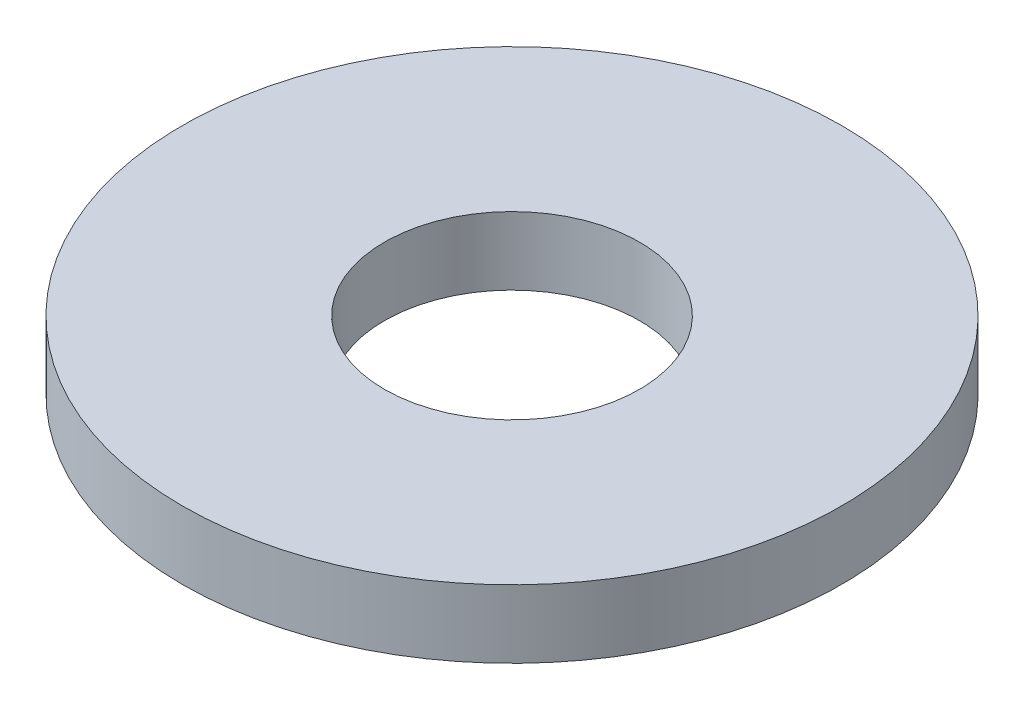
ISO-10303-21;
HEADER;
FILE_DESCRIPTION(('STEP AP214'),'2;1');
FILE_NAME('part.step','',(''),(''),'','','');
FILE_SCHEMA(('AUTOMOTIVE_DESIGN { 1 0 10303 214 1 1 1 1 }'));
ENDSEC;
DATA;
#1=APPLICATION_CONTEXT('core data for automotive mechanical design processes');
#2=APPLICATION_PROTOCOL_DEFINITION('international standard','automotive_design',2000,#1);
#3=PRODUCT_CONTEXT('',#1,'mechanical');
#4=PRODUCT('Part','Part','',(#3));
#5=PRODUCT_RELATED_PRODUCT_CATEGORY('part','',(#4));
#6=PRODUCT_DEFINITION_FORMATION('','',#4);
#7=PRODUCT_DEFINITION_CONTEXT('part definition',#1,'design');
#8=PRODUCT_DEFINITION('design','',#6,#7);
#9=PRODUCT_DEFINITION_SHAPE('','',#8);
#10=(LENGTH_UNIT() NAMED_UNIT(*) SI_UNIT(.MILLI.,.METRE.));
#11=(NAMED_UNIT(*) PLANE_ANGLE_UNIT() SI_UNIT($,.RADIAN.));
#12=(NAMED_UNIT(*) SI_UNIT($,.STERADIAN.) SOLID_ANGLE_UNIT());
#13=UNCERTAINTY_MEASURE_WITH_UNIT(LENGTH_MEASURE(1.E-05),#10,'distance_accuracy_value','');
#14=(GEOMETRIC_REPRESENTATION_CONTEXT(3) GLOBAL_UNCERTAINTY_ASSIGNED_CONTEXT((#13)) GLOBAL_UNIT_ASSIGNED_CONTEXT((#10,
#11,#12)) REPRESENTATION_CONTEXT('',''));
#15=CARTESIAN_POINT('',(0.,0.,0.));
#16=DIRECTION('',(0.,0.,1.));
#17=DIRECTION('',(1.,0.,0.));
#18=AXIS2_PLACEMENT_3D('',#15,#16,#17);
#19=CARTESIAN_POINT('',(0.,16.,0.));
#20=DIRECTION('',(0.,-1.,0.));
#21=DIRECTION('',(0.,0.,-1.));
#22=AXIS2_PLACEMENT_3D('',#19,#20,#21);
#23=CYLINDRICAL_SURFACE('',#22,77.5);
#24=CARTESIAN_POINT('',(0.,16.,0.));
#25=DIRECTION('',(0.,1.,0.));
#26=DIRECTION('',(0.,0.,1.));
#27=AXIS2_PLACEMENT_3D('',#24,#25,#26);
#28=CIRCLE('',#27,77.5);
#29=CARTESIAN_POINT('',(0.,16.,77.5));
#30=VERTEX_POINT('',#29);
#31=EDGE_CURVE('E10',#30,#30,#28,.T.);
#32=ORIENTED_EDGE('',*,*,#31,.F.);
#33=EDGE_LOOP('',(#32));
#34=FACE_BOUND('',#33,.T.);
#35=CARTESIAN_POINT('',(0.,0.,0.));
#36=DIRECTION('',(0.,1.,0.));
#37=DIRECTION('',(0.,0.,1.));
#38=AXIS2_PLACEMENT_3D('',#35,#36,#37);
#39=CIRCLE('',#38,77.5);
#40=CARTESIAN_POINT('',(0.,0.,77.5));
#41=VERTEX_POINT('',#40);
#42=EDGE_CURVE('E37',#41,#41,#39,.T.);
#43=ORIENTED_EDGE('',*,*,#42,.T.);
#44=EDGE_LOOP('',(#43));
#45=FACE_BOUND('',#44,.T.);
#46=ADVANCED_FACE('F40',(#34,#45),#23,.T.);
#47=CARTESIAN_POINT('',(0.,16.,0.));
#48=DIRECTION('',(0.,1.,0.));
#49=DIRECTION('',(0.,0.,1.));
#50=AXIS2_PLACEMENT_3D('',#47,#48,#49);
#51=PLANE('',#50);
#52=CARTESIAN_POINT('',(0.,16.,0.));
#53=DIRECTION('',(0.,1.,0.));
#54=DIRECTION('',(0.,0.,1.));
#55=AXIS2_PLACEMENT_3D('',#52,#53,#54);
#56=CIRCLE('',#55,30.);
#57=CARTESIAN_POINT('',(0.,16.,30.));
#58=VERTEX_POINT('',#57);
#59=EDGE_CURVE('E50',#58,#58,#56,.T.);
#60=ORIENTED_EDGE('',*,*,#59,.F.);
#61=EDGE_LOOP('',(#60));
#62=FACE_BOUND('',#61,.T.);
#63=ORIENTED_EDGE('',*,*,#31,.T.);
#64=EDGE_LOOP('',(#63));
#65=FACE_BOUND('',#64,.T.);
#66=ADVANCED_FACE('F59',(#62,#65),#51,.T.);
#67=CARTESIAN_POINT('',(0.,0.,0.));
#68=DIRECTION('',(0.,1.,0.));
#69=DIRECTION('',(0.,0.,1.));
#70=AXIS2_PLACEMENT_3D('',#67,#68,#69);
#71=PLANE('',#70);
#72=CARTESIAN_POINT('',(0.,0.,0.));
#73=DIRECTION('',(0.,1.,0.));
#74=DIRECTION('',(0.,0.,1.));
#75=AXIS2_PLACEMENT_3D('',#72,#73,#74);
#76=CIRCLE('',#75,30.);
#77=CARTESIAN_POINT('',(0.,0.,30.));
#78=VERTEX_POINT('',#77);
#79=EDGE_CURVE('E47',#78,#78,#76,.T.);
#80=ORIENTED_EDGE('',*,*,#79,.T.);
#81=EDGE_LOOP('',(#80));
#82=FACE_BOUND('',#81,.T.);
#83=ORIENTED_EDGE('',*,*,#42,.F.);
#84=EDGE_LOOP('',(#83));
#85=FACE_BOUND('',#84,.T.);
#86=ADVANCED_FACE('F58',(#82,#85),#71,.F.);
#87=CARTESIAN_POINT('',(0.,16.,0.));
#88=DIRECTION('',(0.,-1.,0.));
#89=DIRECTION('',(0.,0.,-1.));
#90=AXIS2_PLACEMENT_3D('',#87,#88,#89);
#91=CYLINDRICAL_SURFACE('',#90,30.);
#92=ORIENTED_EDGE('',*,*,#59,.T.);
#93=EDGE_LOOP('',(#92));
#94=FACE_BOUND('',#93,.T.);
#95=ORIENTED_EDGE('',*,*,#79,.F.);
#96=EDGE_LOOP('',(#95));
#97=FACE_BOUND('',#96,.T.);
#98=ADVANCED_FACE('F54',(#94,#97),#91,.F.);
#99=CLOSED_SHELL('',(#46,#66,#86,#98));
#100=MANIFOLD_SOLID_BREP('B2',#99);
#101=ADVANCED_BREP_SHAPE_REPRESENTATION('',(#18,#100),#14);
#102=SHAPE_DEFINITION_REPRESENTATION(#9,#101);
ENDSEC;
END-ISO-10303-21;
